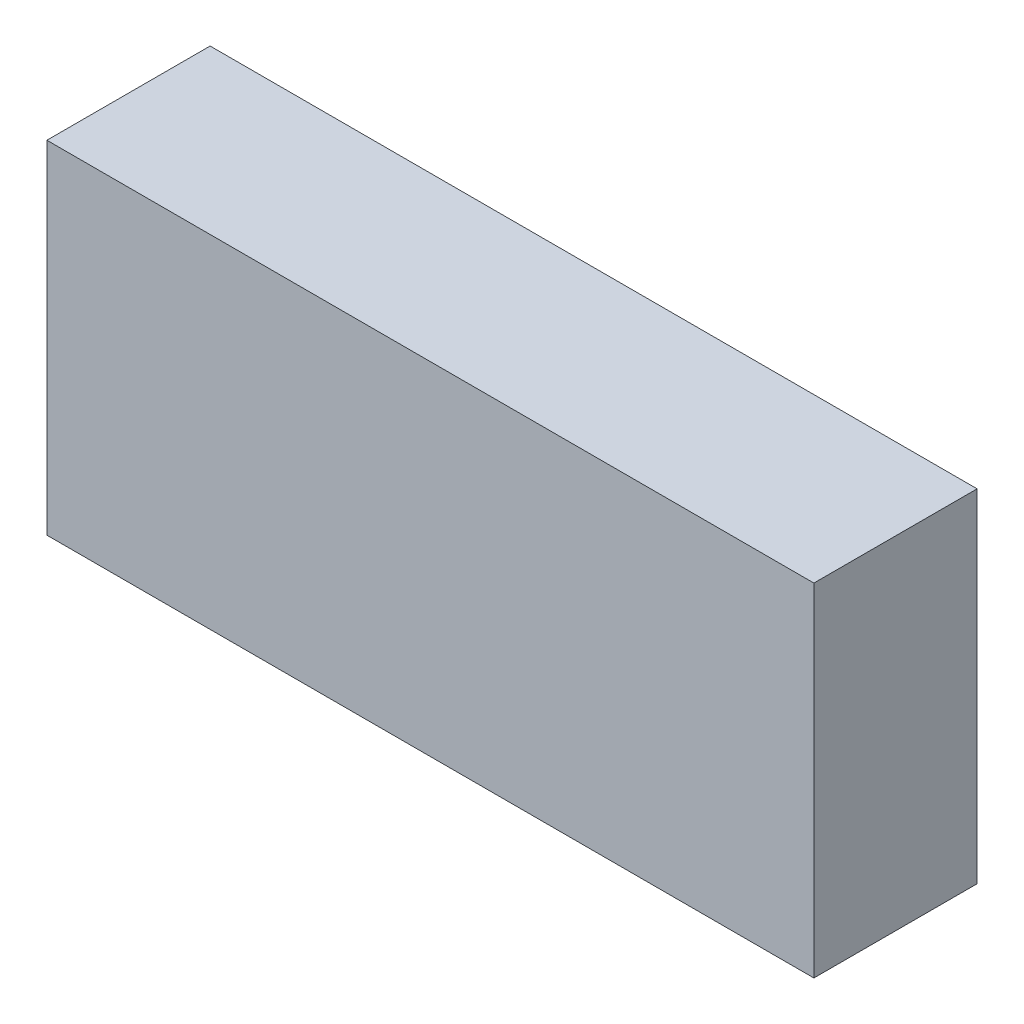
ISO-10303-21;
HEADER;
FILE_DESCRIPTION(('STEP AP214'),'2;1');
FILE_NAME('part.step','',(''),(''),'','','');
FILE_SCHEMA(('AUTOMOTIVE_DESIGN { 1 0 10303 214 1 1 1 1 }'));
ENDSEC;
DATA;
#1=APPLICATION_CONTEXT('core data for automotive mechanical design processes');
#2=APPLICATION_PROTOCOL_DEFINITION('international standard','automotive_design',2000,#1);
#3=PRODUCT_CONTEXT('',#1,'mechanical');
#4=PRODUCT('Part','Part','',(#3));
#5=PRODUCT_RELATED_PRODUCT_CATEGORY('part','',(#4));
#6=PRODUCT_DEFINITION_FORMATION('','',#4);
#7=PRODUCT_DEFINITION_CONTEXT('part definition',#1,'design');
#8=PRODUCT_DEFINITION('design','',#6,#7);
#9=PRODUCT_DEFINITION_SHAPE('','',#8);
#10=(LENGTH_UNIT() NAMED_UNIT(*) SI_UNIT(.MILLI.,.METRE.));
#11=(NAMED_UNIT(*) PLANE_ANGLE_UNIT() SI_UNIT($,.RADIAN.));
#12=(NAMED_UNIT(*) SI_UNIT($,.STERADIAN.) SOLID_ANGLE_UNIT());
#13=UNCERTAINTY_MEASURE_WITH_UNIT(LENGTH_MEASURE(1.E-05),#10,'distance_accuracy_value','');
#14=(GEOMETRIC_REPRESENTATION_CONTEXT(3) GLOBAL_UNCERTAINTY_ASSIGNED_CONTEXT((#13)) GLOBAL_UNIT_ASSIGNED_CONTEXT((#10,
#11,#12)) REPRESENTATION_CONTEXT('',''));
#15=CARTESIAN_POINT('',(0.,0.,0.));
#16=DIRECTION('',(0.,0.,1.));
#17=DIRECTION('',(1.,0.,0.));
#18=AXIS2_PLACEMENT_3D('',#15,#16,#17);
#19=CARTESIAN_POINT('',(-2.3495,-1.016,1.));
#20=DIRECTION('',(1.,0.,0.));
#21=DIRECTION('',(0.,0.,-1.));
#22=AXIS2_PLACEMENT_3D('',#19,#20,#21);
#23=PLANE('',#22);
#24=DIRECTION('',(0.,-1.,0.));
#25=VECTOR('',#24,1.);
#26=CARTESIAN_POINT('',(-2.3495,-1.016,0.));
#27=LINE('',#26,#25);
#28=CARTESIAN_POINT('',(-2.3495,1.0795,0.));
#29=VERTEX_POINT('',#28);
#30=CARTESIAN_POINT('',(-2.3495,-1.016,0.));
#31=VERTEX_POINT('',#30);
#32=EDGE_CURVE('E95',#29,#31,#27,.T.);
#33=ORIENTED_EDGE('',*,*,#32,.T.);
#34=DIRECTION('',(0.,0.,-1.));
#35=VECTOR('',#34,1.);
#36=CARTESIAN_POINT('',(-2.3495,-1.016,1.));
#37=LINE('',#36,#35);
#38=CARTESIAN_POINT('',(-2.3495,-1.016,1.));
#39=VERTEX_POINT('',#38);
#40=EDGE_CURVE('E11',#39,#31,#37,.T.);
#41=ORIENTED_EDGE('',*,*,#40,.F.);
#42=DIRECTION('',(0.,-1.,0.));
#43=VECTOR('',#42,1.);
#44=CARTESIAN_POINT('',(-2.3495,-1.016,1.));
#45=LINE('',#44,#43);
#46=CARTESIAN_POINT('',(-2.3495,1.0795,1.));
#47=VERTEX_POINT('',#46);
#48=EDGE_CURVE('E83',#47,#39,#45,.T.);
#49=ORIENTED_EDGE('',*,*,#48,.F.);
#50=DIRECTION('',(0.,0.,-1.));
#51=VECTOR('',#50,1.);
#52=CARTESIAN_POINT('',(-2.3495,1.0795,1.));
#53=LINE('',#52,#51);
#54=EDGE_CURVE('E91',#47,#29,#53,.T.);
#55=ORIENTED_EDGE('',*,*,#54,.T.);
#56=EDGE_LOOP('',(#33,#41,#49,#55));
#57=FACE_BOUND('',#56,.T.);
#58=ADVANCED_FACE('F32',(#57),#23,.F.);
#59=CARTESIAN_POINT('',(2.3495,-1.016,1.));
#60=DIRECTION('',(0.,1.,0.));
#61=DIRECTION('',(0.,0.,1.));
#62=AXIS2_PLACEMENT_3D('',#59,#60,#61);
#63=PLANE('',#62);
#64=DIRECTION('',(1.,0.,0.));
#65=VECTOR('',#64,1.);
#66=CARTESIAN_POINT('',(2.3495,-1.016,0.));
#67=LINE('',#66,#65);
#68=CARTESIAN_POINT('',(2.3495,-1.016,0.));
#69=VERTEX_POINT('',#68);
#70=EDGE_CURVE('E87',#31,#69,#67,.T.);
#71=ORIENTED_EDGE('',*,*,#70,.T.);
#72=DIRECTION('',(0.,0.,-1.));
#73=VECTOR('',#72,1.);
#74=CARTESIAN_POINT('',(2.3495,-1.016,1.));
#75=LINE('',#74,#73);
#76=CARTESIAN_POINT('',(2.3495,-1.016,1.));
#77=VERTEX_POINT('',#76);
#78=EDGE_CURVE('E40',#77,#69,#75,.T.);
#79=ORIENTED_EDGE('',*,*,#78,.F.);
#80=DIRECTION('',(1.,0.,0.));
#81=VECTOR('',#80,1.);
#82=CARTESIAN_POINT('',(2.3495,-1.016,1.));
#83=LINE('',#82,#81);
#84=EDGE_CURVE('E78',#39,#77,#83,.T.);
#85=ORIENTED_EDGE('',*,*,#84,.F.);
#86=ORIENTED_EDGE('',*,*,#40,.T.);
#87=EDGE_LOOP('',(#71,#79,#85,#86));
#88=FACE_BOUND('',#87,.T.);
#89=ADVANCED_FACE('F86',(#88),#63,.F.);
#90=CARTESIAN_POINT('',(2.3495,1.0795,1.));
#91=DIRECTION('',(-1.,0.,0.));
#92=DIRECTION('',(0.,0.,1.));
#93=AXIS2_PLACEMENT_3D('',#90,#91,#92);
#94=PLANE('',#93);
#95=DIRECTION('',(0.,1.,0.));
#96=VECTOR('',#95,1.);
#97=CARTESIAN_POINT('',(2.3495,1.0795,0.));
#98=LINE('',#97,#96);
#99=CARTESIAN_POINT('',(2.3495,1.0795,0.));
#100=VERTEX_POINT('',#99);
#101=EDGE_CURVE('E65',#69,#100,#98,.T.);
#102=ORIENTED_EDGE('',*,*,#101,.T.);
#103=DIRECTION('',(0.,0.,-1.));
#104=VECTOR('',#103,1.);
#105=CARTESIAN_POINT('',(2.3495,1.0795,1.));
#106=LINE('',#105,#104);
#107=CARTESIAN_POINT('',(2.3495,1.0795,1.));
#108=VERTEX_POINT('',#107);
#109=EDGE_CURVE('E88',#108,#100,#106,.T.);
#110=ORIENTED_EDGE('',*,*,#109,.F.);
#111=DIRECTION('',(0.,1.,0.));
#112=VECTOR('',#111,1.);
#113=CARTESIAN_POINT('',(2.3495,1.0795,1.));
#114=LINE('',#113,#112);
#115=EDGE_CURVE('E81',#77,#108,#114,.T.);
#116=ORIENTED_EDGE('',*,*,#115,.F.);
#117=ORIENTED_EDGE('',*,*,#78,.T.);
#118=EDGE_LOOP('',(#102,#110,#116,#117));
#119=FACE_BOUND('',#118,.T.);
#120=ADVANCED_FACE('F89',(#119),#94,.F.);
#121=CARTESIAN_POINT('',(-2.3495,1.0795,1.));
#122=DIRECTION('',(0.,-1.,0.));
#123=DIRECTION('',(0.,0.,-1.));
#124=AXIS2_PLACEMENT_3D('',#121,#122,#123);
#125=PLANE('',#124);
#126=DIRECTION('',(-1.,0.,0.));
#127=VECTOR('',#126,1.);
#128=CARTESIAN_POINT('',(-2.3495,1.0795,0.));
#129=LINE('',#128,#127);
#130=EDGE_CURVE('E71',#100,#29,#129,.T.);
#131=ORIENTED_EDGE('',*,*,#130,.T.);
#132=ORIENTED_EDGE('',*,*,#54,.F.);
#133=DIRECTION('',(-1.,0.,0.));
#134=VECTOR('',#133,1.);
#135=CARTESIAN_POINT('',(-2.3495,1.0795,1.));
#136=LINE('',#135,#134);
#137=EDGE_CURVE('E48',#108,#47,#136,.T.);
#138=ORIENTED_EDGE('',*,*,#137,.F.);
#139=ORIENTED_EDGE('',*,*,#109,.T.);
#140=EDGE_LOOP('',(#131,#132,#138,#139));
#141=FACE_BOUND('',#140,.T.);
#142=ADVANCED_FACE('F102',(#141),#125,.F.);
#143=CARTESIAN_POINT('',(0.,0.,1.));
#144=DIRECTION('',(0.,0.,-1.));
#145=DIRECTION('',(-1.,0.,0.));
#146=AXIS2_PLACEMENT_3D('',#143,#144,#145);
#147=PLANE('',#146);
#148=ORIENTED_EDGE('',*,*,#48,.T.);
#149=ORIENTED_EDGE('',*,*,#84,.T.);
#150=ORIENTED_EDGE('',*,*,#115,.T.);
#151=ORIENTED_EDGE('',*,*,#137,.T.);
#152=EDGE_LOOP('',(#148,#149,#150,#151));
#153=FACE_BOUND('',#152,.T.);
#154=ADVANCED_FACE('F79',(#153),#147,.F.);
#155=CARTESIAN_POINT('',(0.,0.,0.));
#156=DIRECTION('',(0.,0.,-1.));
#157=DIRECTION('',(-1.,0.,0.));
#158=AXIS2_PLACEMENT_3D('',#155,#156,#157);
#159=PLANE('',#158);
#160=ORIENTED_EDGE('',*,*,#32,.F.);
#161=ORIENTED_EDGE('',*,*,#130,.F.);
#162=ORIENTED_EDGE('',*,*,#101,.F.);
#163=ORIENTED_EDGE('',*,*,#70,.F.);
#164=EDGE_LOOP('',(#160,#161,#162,#163));
#165=FACE_BOUND('',#164,.T.);
#166=ADVANCED_FACE('F105',(#165),#159,.T.);
#167=CLOSED_SHELL('',(#58,#89,#120,#142,#154,#166));
#168=MANIFOLD_SOLID_BREP('B2',#167);
#169=ADVANCED_BREP_SHAPE_REPRESENTATION('',(#18,#168),#14);
#170=SHAPE_DEFINITION_REPRESENTATION(#9,#169);
ENDSEC;
END-ISO-10303-21;
